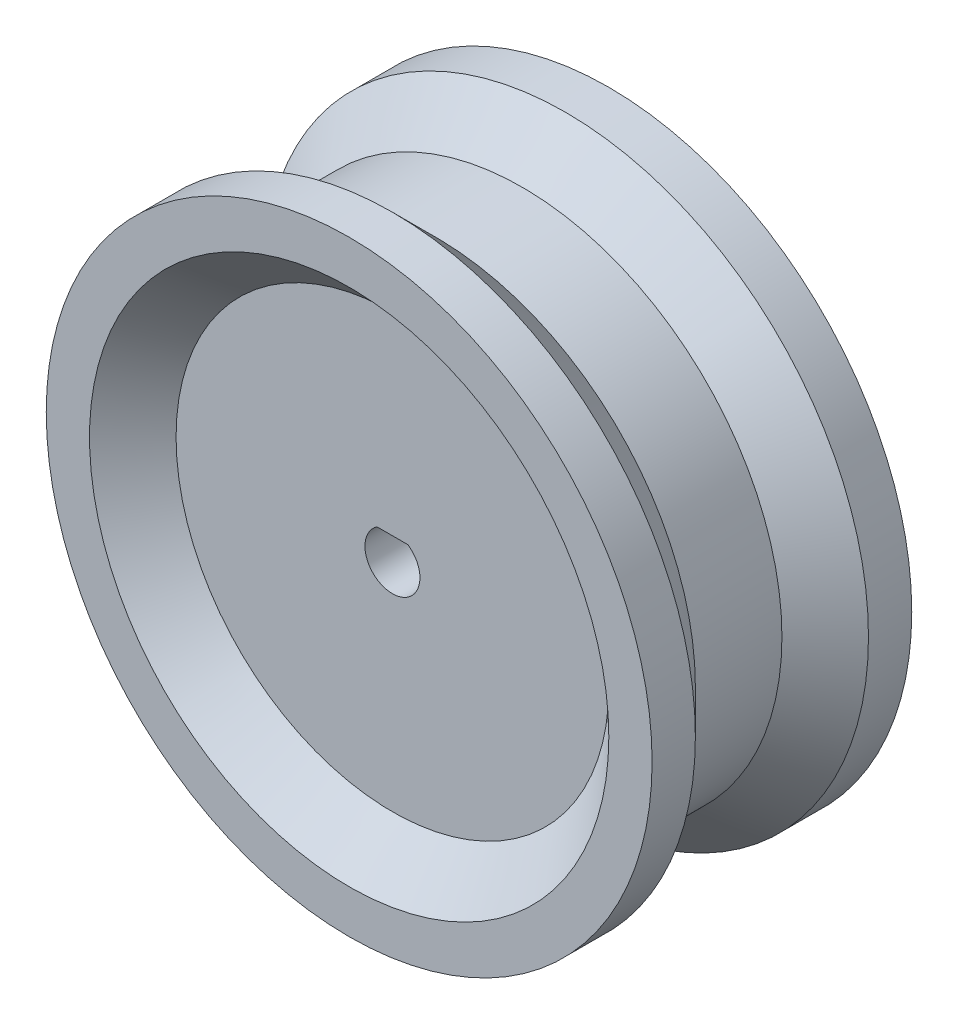
ISO-10303-21;
HEADER;
FILE_DESCRIPTION(('STEP AP214'),'2;1');
FILE_NAME('part.step','',(''),(''),'','','');
FILE_SCHEMA(('AUTOMOTIVE_DESIGN { 1 0 10303 214 1 1 1 1 }'));
ENDSEC;
DATA;
#1=APPLICATION_CONTEXT('core data for automotive mechanical design processes');
#2=APPLICATION_PROTOCOL_DEFINITION('international standard','automotive_design',2000,#1);
#3=PRODUCT_CONTEXT('',#1,'mechanical');
#4=PRODUCT('Part','Part','',(#3));
#5=PRODUCT_RELATED_PRODUCT_CATEGORY('part','',(#4));
#6=PRODUCT_DEFINITION_FORMATION('','',#4);
#7=PRODUCT_DEFINITION_CONTEXT('part definition',#1,'design');
#8=PRODUCT_DEFINITION('design','',#6,#7);
#9=PRODUCT_DEFINITION_SHAPE('','',#8);
#10=(LENGTH_UNIT() NAMED_UNIT(*) SI_UNIT(.MILLI.,.METRE.));
#11=(NAMED_UNIT(*) PLANE_ANGLE_UNIT() SI_UNIT($,.RADIAN.));
#12=(NAMED_UNIT(*) SI_UNIT($,.STERADIAN.) SOLID_ANGLE_UNIT());
#13=UNCERTAINTY_MEASURE_WITH_UNIT(LENGTH_MEASURE(1.E-05),#10,'distance_accuracy_value','');
#14=(GEOMETRIC_REPRESENTATION_CONTEXT(3) GLOBAL_UNCERTAINTY_ASSIGNED_CONTEXT((#13)) GLOBAL_UNIT_ASSIGNED_CONTEXT((#10,
#11,#12)) REPRESENTATION_CONTEXT('',''));
#15=CARTESIAN_POINT('',(0.,0.,0.));
#16=DIRECTION('',(0.,0.,1.));
#17=DIRECTION('',(1.,0.,0.));
#18=AXIS2_PLACEMENT_3D('',#15,#16,#17);
#19=CARTESIAN_POINT('',(0.,0.,30.));
#20=DIRECTION('',(0.,0.,-1.));
#21=DIRECTION('',(-1.,0.,0.));
#22=AXIS2_PLACEMENT_3D('',#19,#20,#21);
#23=CYLINDRICAL_SURFACE('',#22,35.);
#24=CARTESIAN_POINT('',(0.,0.,30.));
#25=DIRECTION('',(0.,0.,1.));
#26=DIRECTION('',(1.,0.,0.));
#27=AXIS2_PLACEMENT_3D('',#24,#25,#26);
#28=CIRCLE('',#27,35.);
#29=CARTESIAN_POINT('',(35.,0.,30.));
#30=VERTEX_POINT('',#29);
#31=EDGE_CURVE('E119',#30,#30,#28,.T.);
#32=ORIENTED_EDGE('',*,*,#31,.F.);
#33=EDGE_LOOP('',(#32));
#34=FACE_BOUND('',#33,.T.);
#35=CARTESIAN_POINT('',(0.,0.,25.));
#36=DIRECTION('',(0.,0.,1.));
#37=DIRECTION('',(1.,0.,0.));
#38=AXIS2_PLACEMENT_3D('',#35,#36,#37);
#39=CIRCLE('',#38,35.);
#40=CARTESIAN_POINT('',(35.,0.,25.));
#41=VERTEX_POINT('',#40);
#42=EDGE_CURVE('E106',#41,#41,#39,.T.);
#43=ORIENTED_EDGE('',*,*,#42,.T.);
#44=EDGE_LOOP('',(#43));
#45=FACE_BOUND('',#44,.T.);
#46=ADVANCED_FACE('F45',(#34,#45),#23,.T.);
#47=CARTESIAN_POINT('',(0.,0.,30.));
#48=DIRECTION('',(0.,0.,1.));
#49=DIRECTION('',(1.,0.,0.));
#50=AXIS2_PLACEMENT_3D('',#47,#48,#49);
#51=PLANE('',#50);
#52=CARTESIAN_POINT('',(0.,0.,30.));
#53=DIRECTION('',(0.,0.,1.));
#54=DIRECTION('',(1.,0.,0.));
#55=AXIS2_PLACEMENT_3D('',#52,#53,#54);
#56=CIRCLE('',#55,30.);
#57=CARTESIAN_POINT('',(30.,0.,30.));
#58=VERTEX_POINT('',#57);
#59=EDGE_CURVE('E11',#58,#58,#56,.F.);
#60=ORIENTED_EDGE('',*,*,#59,.T.);
#61=EDGE_LOOP('',(#60));
#62=FACE_BOUND('',#61,.T.);
#63=ORIENTED_EDGE('',*,*,#31,.T.);
#64=EDGE_LOOP('',(#63));
#65=FACE_BOUND('',#64,.T.);
#66=ADVANCED_FACE('F159',(#62,#65),#51,.T.);
#67=CARTESIAN_POINT('',(0.,0.,25.));
#68=DIRECTION('',(0.,0.,1.));
#69=DIRECTION('',(1.,0.,0.));
#70=AXIS2_PLACEMENT_3D('',#67,#68,#69);
#71=PLANE('',#70);
#72=CARTESIAN_POINT('',(0.,0.,25.));
#73=DIRECTION('',(0.,0.,1.));
#74=DIRECTION('',(1.,0.,0.));
#75=AXIS2_PLACEMENT_3D('',#72,#73,#74);
#76=CIRCLE('',#75,3.175);
#77=CARTESIAN_POINT('',(-1.78605710994917,2.625,25.));
#78=VERTEX_POINT('',#77);
#79=CARTESIAN_POINT('',(1.78605710994917,2.625,25.));
#80=VERTEX_POINT('',#79);
#81=EDGE_CURVE('E62',#78,#80,#76,.T.);
#82=ORIENTED_EDGE('',*,*,#81,.F.);
#83=DIRECTION('',(-1.,0.,0.));
#84=VECTOR('',#83,1.);
#85=CARTESIAN_POINT('',(-1.78605710994917,2.625,25.));
#86=LINE('',#85,#84);
#87=EDGE_CURVE('E83',#80,#78,#86,.T.);
#88=ORIENTED_EDGE('',*,*,#87,.F.);
#89=EDGE_LOOP('',(#82,#88));
#90=FACE_BOUND('',#89,.T.);
#91=CARTESIAN_POINT('',(0.,0.,25.));
#92=DIRECTION('',(0.,0.,1.));
#93=DIRECTION('',(1.,0.,0.));
#94=AXIS2_PLACEMENT_3D('',#91,#92,#93);
#95=CIRCLE('',#94,25.);
#96=CARTESIAN_POINT('',(25.,0.,25.));
#97=VERTEX_POINT('',#96);
#98=EDGE_CURVE('E114',#97,#97,#95,.T.);
#99=ORIENTED_EDGE('',*,*,#98,.T.);
#100=EDGE_LOOP('',(#99));
#101=FACE_BOUND('',#100,.T.);
#102=ADVANCED_FACE('F88',(#90,#101),#71,.T.);
#103=CARTESIAN_POINT('',(0.,0.,25.));
#104=DIRECTION('',(0.,0.,1.));
#105=DIRECTION('',(1.,0.,0.));
#106=AXIS2_PLACEMENT_3D('',#103,#104,#105);
#107=CONICAL_SURFACE('',#106,35.,0.78539816339745);
#108=CARTESIAN_POINT('',(0.,0.,20.));
#109=DIRECTION('',(0.,0.,1.));
#110=DIRECTION('',(1.,0.,0.));
#111=AXIS2_PLACEMENT_3D('',#108,#109,#110);
#112=CIRCLE('',#111,30.);
#113=CARTESIAN_POINT('',(30.,0.,20.));
#114=VERTEX_POINT('',#113);
#115=EDGE_CURVE('E102',#114,#114,#112,.T.);
#116=ORIENTED_EDGE('',*,*,#115,.T.);
#117=EDGE_LOOP('',(#116));
#118=FACE_BOUND('',#117,.T.);
#119=ORIENTED_EDGE('',*,*,#42,.F.);
#120=EDGE_LOOP('',(#119));
#121=FACE_BOUND('',#120,.T.);
#122=ADVANCED_FACE('F183',(#118,#121),#107,.T.);
#123=CARTESIAN_POINT('',(0.,0.,49.7676865792456));
#124=DIRECTION('',(0.,0.,1.));
#125=DIRECTION('',(1.,0.,0.));
#126=AXIS2_PLACEMENT_3D('',#123,#124,#125);
#127=CYLINDRICAL_SURFACE('',#126,30.);
#128=CARTESIAN_POINT('',(0.,0.,9.99999999999999));
#129=DIRECTION('',(0.,0.,1.));
#130=DIRECTION('',(1.,0.,0.));
#131=AXIS2_PLACEMENT_3D('',#128,#129,#130);
#132=CIRCLE('',#131,30.);
#133=CARTESIAN_POINT('',(30.,0.,9.99999999999999));
#134=VERTEX_POINT('',#133);
#135=EDGE_CURVE('E98',#134,#134,#132,.T.);
#136=ORIENTED_EDGE('',*,*,#135,.T.);
#137=EDGE_LOOP('',(#136));
#138=FACE_BOUND('',#137,.T.);
#139=ORIENTED_EDGE('',*,*,#115,.F.);
#140=EDGE_LOOP('',(#139));
#141=FACE_BOUND('',#140,.T.);
#142=ADVANCED_FACE('F153',(#138,#141),#127,.T.);
#143=CARTESIAN_POINT('',(0.,0.,9.99999999999999));
#144=DIRECTION('',(0.,0.,-1.));
#145=DIRECTION('',(-1.,0.,0.));
#146=AXIS2_PLACEMENT_3D('',#143,#144,#145);
#147=CONICAL_SURFACE('',#146,30.,0.78539816339745);
#148=CARTESIAN_POINT('',(0.,0.,5.));
#149=DIRECTION('',(0.,0.,1.));
#150=DIRECTION('',(1.,0.,0.));
#151=AXIS2_PLACEMENT_3D('',#148,#149,#150);
#152=CIRCLE('',#151,35.);
#153=CARTESIAN_POINT('',(35.,0.,5.));
#154=VERTEX_POINT('',#153);
#155=EDGE_CURVE('E79',#154,#154,#152,.T.);
#156=ORIENTED_EDGE('',*,*,#155,.T.);
#157=EDGE_LOOP('',(#156));
#158=FACE_BOUND('',#157,.T.);
#159=ORIENTED_EDGE('',*,*,#135,.F.);
#160=EDGE_LOOP('',(#159));
#161=FACE_BOUND('',#160,.T.);
#162=ADVANCED_FACE('F144',(#158,#161),#147,.T.);
#163=CARTESIAN_POINT('',(0.,0.,5.));
#164=DIRECTION('',(0.,0.,-1.));
#165=DIRECTION('',(-1.,0.,0.));
#166=AXIS2_PLACEMENT_3D('',#163,#164,#165);
#167=PLANE('',#166);
#168=CARTESIAN_POINT('',(0.,0.,5.));
#169=DIRECTION('',(0.,0.,-1.));
#170=DIRECTION('',(-1.,0.,0.));
#171=AXIS2_PLACEMENT_3D('',#168,#169,#170);
#172=CIRCLE('',#171,3.175);
#173=CARTESIAN_POINT('',(1.78605710994917,2.625,5.));
#174=VERTEX_POINT('',#173);
#175=CARTESIAN_POINT('',(-1.78605710994917,2.625,5.));
#176=VERTEX_POINT('',#175);
#177=EDGE_CURVE('E76',#174,#176,#172,.T.);
#178=ORIENTED_EDGE('',*,*,#177,.F.);
#179=DIRECTION('',(1.,0.,0.));
#180=VECTOR('',#179,1.);
#181=CARTESIAN_POINT('',(0.,2.625,5.));
#182=LINE('',#181,#180);
#183=EDGE_CURVE('E123',#176,#174,#182,.T.);
#184=ORIENTED_EDGE('',*,*,#183,.F.);
#185=EDGE_LOOP('',(#178,#184));
#186=FACE_BOUND('',#185,.T.);
#187=CARTESIAN_POINT('',(0.,0.,5.));
#188=DIRECTION('',(0.,0.,-1.));
#189=DIRECTION('',(-1.,0.,0.));
#190=AXIS2_PLACEMENT_3D('',#187,#188,#189);
#191=CIRCLE('',#190,25.);
#192=CARTESIAN_POINT('',(-25.,0.,5.));
#193=VERTEX_POINT('',#192);
#194=EDGE_CURVE('E110',#193,#193,#191,.T.);
#195=ORIENTED_EDGE('',*,*,#194,.T.);
#196=EDGE_LOOP('',(#195));
#197=FACE_BOUND('',#196,.T.);
#198=ADVANCED_FACE('F142',(#186,#197),#167,.T.);
#199=CARTESIAN_POINT('',(0.,0.,0.));
#200=DIRECTION('',(0.,0.,1.));
#201=DIRECTION('',(1.,0.,0.));
#202=AXIS2_PLACEMENT_3D('',#199,#200,#201);
#203=PLANE('',#202);
#204=CARTESIAN_POINT('',(0.,0.,0.));
#205=DIRECTION('',(0.,0.,1.));
#206=DIRECTION('',(1.,0.,0.));
#207=AXIS2_PLACEMENT_3D('',#204,#205,#206);
#208=CIRCLE('',#207,30.);
#209=CARTESIAN_POINT('',(30.,0.,0.));
#210=VERTEX_POINT('',#209);
#211=EDGE_CURVE('E55',#210,#210,#208,.T.);
#212=ORIENTED_EDGE('',*,*,#211,.T.);
#213=EDGE_LOOP('',(#212));
#214=FACE_BOUND('',#213,.T.);
#215=CARTESIAN_POINT('',(0.,0.,0.));
#216=DIRECTION('',(0.,0.,1.));
#217=DIRECTION('',(1.,0.,0.));
#218=AXIS2_PLACEMENT_3D('',#215,#216,#217);
#219=CIRCLE('',#218,35.);
#220=CARTESIAN_POINT('',(35.,0.,0.));
#221=VERTEX_POINT('',#220);
#222=EDGE_CURVE('E118',#221,#221,#219,.T.);
#223=ORIENTED_EDGE('',*,*,#222,.F.);
#224=EDGE_LOOP('',(#223));
#225=FACE_BOUND('',#224,.T.);
#226=ADVANCED_FACE('F134',(#214,#225),#203,.F.);
#227=ORIENTED_EDGE('',*,*,#222,.T.);
#228=EDGE_LOOP('',(#227));
#229=FACE_BOUND('',#228,.T.);
#230=ORIENTED_EDGE('',*,*,#155,.F.);
#231=EDGE_LOOP('',(#230));
#232=FACE_BOUND('',#231,.T.);
#233=ADVANCED_FACE('F151',(#229,#232),#23,.T.);
#234=CARTESIAN_POINT('',(0.,0.,-14.));
#235=DIRECTION('',(0.,0.,1.));
#236=DIRECTION('',(1.,0.,0.));
#237=AXIS2_PLACEMENT_3D('',#234,#235,#236);
#238=CYLINDRICAL_SURFACE('',#237,3.175);
#239=ORIENTED_EDGE('',*,*,#177,.T.);
#240=DIRECTION('',(0.,0.,1.));
#241=VECTOR('',#240,1.);
#242=CARTESIAN_POINT('',(-1.78605710994917,2.625,-14.));
#243=LINE('',#242,#241);
#244=EDGE_CURVE('E69',#176,#78,#243,.T.);
#245=ORIENTED_EDGE('',*,*,#244,.T.);
#246=ORIENTED_EDGE('',*,*,#81,.T.);
#247=DIRECTION('',(0.,0.,1.));
#248=VECTOR('',#247,1.);
#249=CARTESIAN_POINT('',(1.78605710994917,2.625,-14.));
#250=LINE('',#249,#248);
#251=EDGE_CURVE('E80',#174,#80,#250,.T.);
#252=ORIENTED_EDGE('',*,*,#251,.F.);
#253=EDGE_LOOP('',(#239,#245,#246,#252));
#254=FACE_BOUND('',#253,.T.);
#255=ADVANCED_FACE('F74',(#254),#238,.F.);
#256=CARTESIAN_POINT('',(-1.78605710994917,2.625,-14.));
#257=DIRECTION('',(0.,1.,0.));
#258=DIRECTION('',(0.,0.,1.));
#259=AXIS2_PLACEMENT_3D('',#256,#257,#258);
#260=PLANE('',#259);
#261=ORIENTED_EDGE('',*,*,#183,.T.);
#262=ORIENTED_EDGE('',*,*,#251,.T.);
#263=ORIENTED_EDGE('',*,*,#87,.T.);
#264=ORIENTED_EDGE('',*,*,#244,.F.);
#265=EDGE_LOOP('',(#261,#262,#263,#264));
#266=FACE_BOUND('',#265,.T.);
#267=ADVANCED_FACE('F84',(#266),#260,.F.);
#268=CARTESIAN_POINT('',(0.,0.,5.));
#269=DIRECTION('',(0.,0.,-1.));
#270=DIRECTION('',(-1.,0.,0.));
#271=AXIS2_PLACEMENT_3D('',#268,#269,#270);
#272=CONICAL_SURFACE('',#271,25.,0.785398163397451);
#273=ORIENTED_EDGE('',*,*,#211,.F.);
#274=EDGE_LOOP('',(#273));
#275=FACE_BOUND('',#274,.T.);
#276=ORIENTED_EDGE('',*,*,#194,.F.);
#277=EDGE_LOOP('',(#276));
#278=FACE_BOUND('',#277,.T.);
#279=ADVANCED_FACE('F137',(#275,#278),#272,.F.);
#280=CARTESIAN_POINT('',(0.,0.,25.));
#281=DIRECTION('',(0.,0.,1.));
#282=DIRECTION('',(1.,0.,0.));
#283=AXIS2_PLACEMENT_3D('',#280,#281,#282);
#284=CONICAL_SURFACE('',#283,25.,0.785398163397451);
#285=ORIENTED_EDGE('',*,*,#59,.F.);
#286=EDGE_LOOP('',(#285));
#287=FACE_BOUND('',#286,.T.);
#288=ORIENTED_EDGE('',*,*,#98,.F.);
#289=EDGE_LOOP('',(#288));
#290=FACE_BOUND('',#289,.T.);
#291=ADVANCED_FACE('F48',(#287,#290),#284,.F.);
#292=CLOSED_SHELL('',(#46,#66,#102,#122,#142,#162,#198,#226,#233,#255,#267,#279,#291));
#293=MANIFOLD_SOLID_BREP('B2',#292);
#294=ADVANCED_BREP_SHAPE_REPRESENTATION('',(#18,#293),#14);
#295=SHAPE_DEFINITION_REPRESENTATION(#9,#294);
ENDSEC;
END-ISO-10303-21;
